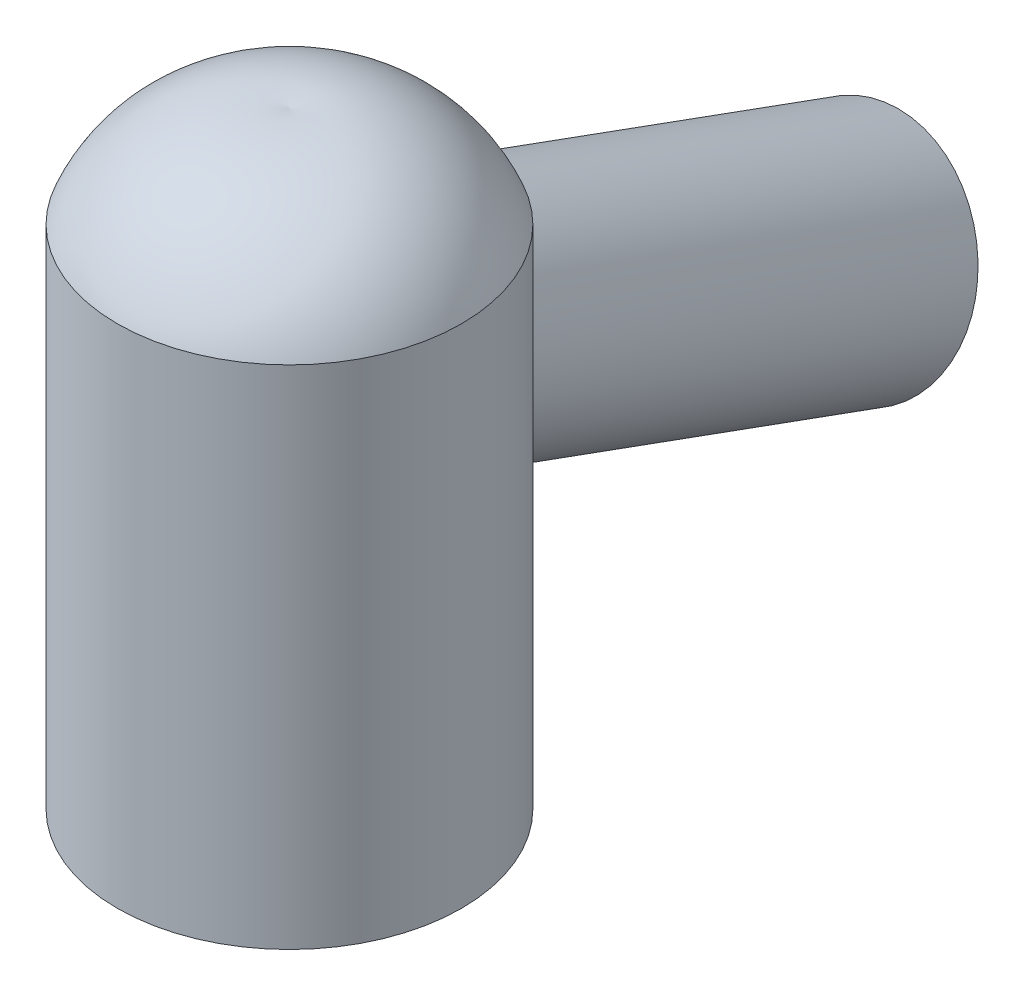
ISO-10303-21;
HEADER;
FILE_DESCRIPTION(('STEP AP214'),'2;1');
FILE_NAME('part.step','',(''),(''),'','','');
FILE_SCHEMA(('AUTOMOTIVE_DESIGN { 1 0 10303 214 1 1 1 1 }'));
ENDSEC;
DATA;
#1=APPLICATION_CONTEXT('core data for automotive mechanical design processes');
#2=APPLICATION_PROTOCOL_DEFINITION('international standard','automotive_design',2000,#1);
#3=PRODUCT_CONTEXT('',#1,'mechanical');
#4=PRODUCT('Part','Part','',(#3));
#5=PRODUCT_RELATED_PRODUCT_CATEGORY('part','',(#4));
#6=PRODUCT_DEFINITION_FORMATION('','',#4);
#7=PRODUCT_DEFINITION_CONTEXT('part definition',#1,'design');
#8=PRODUCT_DEFINITION('design','',#6,#7);
#9=PRODUCT_DEFINITION_SHAPE('','',#8);
#10=(LENGTH_UNIT() NAMED_UNIT(*) SI_UNIT(.MILLI.,.METRE.));
#11=(NAMED_UNIT(*) PLANE_ANGLE_UNIT() SI_UNIT($,.RADIAN.));
#12=(NAMED_UNIT(*) SI_UNIT($,.STERADIAN.) SOLID_ANGLE_UNIT());
#13=UNCERTAINTY_MEASURE_WITH_UNIT(LENGTH_MEASURE(1.E-05),#10,'distance_accuracy_value','');
#14=(GEOMETRIC_REPRESENTATION_CONTEXT(3) GLOBAL_UNCERTAINTY_ASSIGNED_CONTEXT((#13)) GLOBAL_UNIT_ASSIGNED_CONTEXT((#10,
#11,#12)) REPRESENTATION_CONTEXT('',''));
#15=CARTESIAN_POINT('',(0.,0.,0.));
#16=DIRECTION('',(0.,0.,1.));
#17=DIRECTION('',(1.,0.,0.));
#18=AXIS2_PLACEMENT_3D('',#15,#16,#17);
#19=CARTESIAN_POINT('',(0.,25.,0.));
#20=DIRECTION('',(0.,-1.,0.));
#21=DIRECTION('',(0.,0.,-1.));
#22=AXIS2_PLACEMENT_3D('',#19,#20,#21);
#23=CYLINDRICAL_SURFACE('',#22,8.5);
#24=CARTESIAN_POINT('',(0.,22.7592307573548,-8.5));
#25=CARTESIAN_POINT('',(0.150595067159695,22.7592302077877,-8.49999902727037));
#26=CARTESIAN_POINT('',(0.30121214763485,22.7541016183976,-8.49598976296606));
#27=CARTESIAN_POINT('',(0.601385081197717,22.7336131139282,-8.48003209892369));
#28=CARTESIAN_POINT('',(0.750940389950452,22.7182482869277,-8.46807988772093));
#29=CARTESIAN_POINT('',(1.04807162124385,22.6773434857078,-8.4364625741855));
#30=CARTESIAN_POINT('',(1.1956440377708,22.6517874515007,-8.41678529894236));
#31=CARTESIAN_POINT('',(1.48757377260865,22.5906321443636,-8.37012454733665));
#32=CARTESIAN_POINT('',(1.63192979634185,22.5550289035616,-8.34313818461787));
#33=CARTESIAN_POINT('',(1.91595348408234,22.4740872908909,-8.28252043151505));
#34=CARTESIAN_POINT('',(2.05563414460332,22.4287790466718,-8.24890963087172));
#35=CARTESIAN_POINT('',(2.32992995855837,22.3285397586367,-8.17567034856265));
#36=CARTESIAN_POINT('',(2.46454316517492,22.2736050614456,-8.13603958299819));
#37=CARTESIAN_POINT('',(2.72776577118698,22.1543504740688,-8.05160780366938));
#38=CARTESIAN_POINT('',(2.85637824648766,22.0900354634589,-8.00680948055186));
#39=CARTESIAN_POINT('',(3.10698870454238,21.9521463359055,-7.91293469492467));
#40=CARTESIAN_POINT('',(3.22898349100475,21.8785678007351,-7.86385619444492));
#41=CARTESIAN_POINT('',(3.46952838393685,21.719737160123,-7.76080241755362));
#42=CARTESIAN_POINT('',(3.5878300489095,21.6341788224731,-7.70671871979084));
#43=CARTESIAN_POINT('',(3.81578324672473,21.4535568494065,-7.59643488237149));
#44=CARTESIAN_POINT('',(3.9254387583245,21.3584976322809,-7.54023573399466));
#45=CARTESIAN_POINT('',(4.13555091640766,21.1588769629079,-7.4270768329607));
#46=CARTESIAN_POINT('',(4.23599849385566,21.0543063404046,-7.37011639242225));
#47=CARTESIAN_POINT('',(4.42680076108425,20.8359616412575,-7.25711537135729));
#48=CARTESIAN_POINT('',(4.51716061131283,20.7221923221092,-7.20107433313684));
#49=CARTESIAN_POINT('',(4.68648247491537,20.4865352847654,-7.09203430160564));
#50=CARTESIAN_POINT('',(4.76552337165715,20.3647133738945,-7.03901597878351));
#51=CARTESIAN_POINT('',(4.91222609640696,20.1127304607862,-6.93743440175615));
#52=CARTESIAN_POINT('',(4.97989468496004,19.9825744769552,-6.88886850855675));
#53=CARTESIAN_POINT('',(5.10313430660092,19.7148427704883,-6.79807878971528));
#54=CARTESIAN_POINT('',(5.15872720589601,19.5772810314019,-6.75584354450727));
#55=CARTESIAN_POINT('',(5.25745350938184,19.295640352303,-6.67930362018277));
#56=CARTESIAN_POINT('',(5.30058965228421,19.1515628528985,-6.64499719818653));
#57=CARTESIAN_POINT('',(5.36863982039829,18.8804068056346,-6.59009230260482));
#58=CARTESIAN_POINT('',(5.39531787852993,18.7540265281905,-6.56820870468501));
#59=CARTESIAN_POINT('',(5.43957202389027,18.498612740854,-6.53160659266219));
#60=CARTESIAN_POINT('',(5.45714491864975,18.3695783168244,-6.51689059178365));
#61=CARTESIAN_POINT('',(5.48340450185452,18.1099405050581,-6.49481100247284));
#62=CARTESIAN_POINT('',(5.49208741596057,17.979336474716,-6.48745053694589));
#63=CARTESIAN_POINT('',(5.50093862547104,17.7176870035076,-6.47994621255126));
#64=CARTESIAN_POINT('',(5.50110893167303,17.5866416741966,-6.47980064942235));
#65=CARTESIAN_POINT('',(5.4926421774879,17.2984457208055,-6.48698158169763));
#66=CARTESIAN_POINT('',(5.48221416896205,17.1413838888558,-6.49582753908152));
#67=CARTESIAN_POINT('',(5.45065767348368,16.829134047329,-6.52232568127632));
#68=CARTESIAN_POINT('',(5.42952685824862,16.6739464529965,-6.53997978219332));
#69=CARTESIAN_POINT('',(5.35128572454736,16.211898466983,-6.60442246088304));
#70=CARTESIAN_POINT('',(5.27934539157401,15.9090213315867,-6.66267309028977));
#71=CARTESIAN_POINT('',(5.1292598218117,15.411199816664,-6.77839175036924));
#72=CARTESIAN_POINT('',(5.06006353535934,15.2120796574478,-6.83042659947094));
#73=CARTESIAN_POINT('',(4.90647780989961,14.8216848620278,-6.94157592899216));
#74=CARTESIAN_POINT('',(4.82208211660757,14.630413495393,-7.00069332038645));
#75=CARTESIAN_POINT('',(4.63860179758311,14.2565142602597,-7.12359285210665));
#76=CARTESIAN_POINT('',(4.53950904881465,14.0738912458011,-7.18737756211069));
#77=CARTESIAN_POINT('',(4.3267868762706,13.7182905818512,-7.31740773713319));
#78=CARTESIAN_POINT('',(4.21316188805855,13.5453100123063,-7.38365244694479));
#79=CARTESIAN_POINT('',(3.99238378669133,13.2395439327986,-7.50492054819431));
#80=CARTESIAN_POINT('',(3.88758652376008,13.1050271184749,-7.55987581154332));
#81=CARTESIAN_POINT('',(3.66774429367691,12.8442371023581,-7.6689447678973));
#82=CARTESIAN_POINT('',(3.55269894467173,12.7179642080451,-7.72305842945508));
#83=CARTESIAN_POINT('',(3.31239621494932,12.4751154640299,-7.82912690245986));
#84=CARTESIAN_POINT('',(3.18716275446289,12.3585181285688,-7.88108636168011));
#85=CARTESIAN_POINT('',(2.92615399621796,12.13621467794,-7.98168005241646));
#86=CARTESIAN_POINT('',(2.79037842410831,12.0305088463828,-8.03031419733158));
#87=CARTESIAN_POINT('',(2.44715179700049,11.7888012392102,-8.14288306216883));
#88=CARTESIAN_POINT('',(2.23405261286942,11.6594076773036,-8.20436498271127));
#89=CARTESIAN_POINT('',(1.89952682596397,11.4898928881746,-8.28583216970473));
#90=CARTESIAN_POINT('',(1.78550986667734,11.4374743510148,-8.31120003186689));
#91=CARTESIAN_POINT('',(1.55292803656773,11.3416903049842,-8.3577781127885));
#92=CARTESIAN_POINT('',(1.43436524116948,11.2983207216803,-8.37899020248587));
#93=CARTESIAN_POINT('',(1.192042594445,11.2210840433057,-8.41690166336664));
#94=CARTESIAN_POINT('',(1.06824082811628,11.1873231236481,-8.43355054206334));
#95=CARTESIAN_POINT('',(0.817559019686375,11.130719177093,-8.46153036731061));
#96=CARTESIAN_POINT('',(0.690679002884789,11.1078760604959,-8.47286135755239));
#97=CARTESIAN_POINT('',(0.435105678160918,11.0737240636548,-8.4898214746802));
#98=CARTESIAN_POINT('',(0.306414083693191,11.0624049409733,-8.4954556648079));
#99=CARTESIAN_POINT('',(0.0484188482765502,11.0515854493114,-8.50084080214499));
#100=CARTESIAN_POINT('',(-0.0808847058892342,11.0520834519321,-8.50059255995299));
#101=CARTESIAN_POINT('',(-0.319583905701683,11.0639228401787,-8.49470053081617));
#102=CARTESIAN_POINT('',(-0.429084349058265,11.073642946439,-8.48986348388972));
#103=CARTESIAN_POINT('',(-0.646789191214288,11.1014360902037,-8.47605812753648));
#104=CARTESIAN_POINT('',(-0.754993191972644,11.1195116288671,-8.46708858106817));
#105=CARTESIAN_POINT('',(-0.969351505350982,11.163672425484,-8.44523341707152));
#106=CARTESIAN_POINT('',(-1.07550566205435,11.1897582901934,-8.43234750289191));
#107=CARTESIAN_POINT('',(-1.28516126294924,11.2494796728919,-8.40295028694009));
#108=CARTESIAN_POINT('',(-1.38866215922618,11.2831167364778,-8.38643824297839));
#109=CARTESIAN_POINT('',(-1.61774921862148,11.3666111406835,-8.34563103948399));
#110=CARTESIAN_POINT('',(-1.74246410038297,11.4184225589371,-8.32042098881983));
#111=CARTESIAN_POINT('',(-1.98629971000509,11.5318630078975,-8.26560687980744));
#112=CARTESIAN_POINT('',(-2.10541917239137,11.5934942457694,-8.23600183371453));
#113=CARTESIAN_POINT('',(-2.45407260722473,11.7916925477227,-8.14158936555265));
#114=CARTESIAN_POINT('',(-2.674723728475,11.9414969097521,-8.07121804016957));
#115=CARTESIAN_POINT('',(-3.02637828589024,12.2179083323858,-7.94446191870476));
#116=CARTESIAN_POINT('',(-3.1640451353018,12.3374249191361,-7.89045526434821));
#117=CARTESIAN_POINT('',(-3.42756866983338,12.5876903886121,-7.77959985488574));
#118=CARTESIAN_POINT('',(-3.55342448941366,12.718440093184,-7.72275089195603));
#119=CARTESIAN_POINT('',(-3.79370615065001,12.9898192163119,-7.60760042325959));
#120=CARTESIAN_POINT('',(-3.90811255821102,13.1304647653841,-7.54929665082169));
#121=CARTESIAN_POINT('',(-4.12552725583711,13.420266841557,-7.43271360625303));
#122=CARTESIAN_POINT('',(-4.22853683493595,13.5694224032377,-7.37443433209572));
#123=CARTESIAN_POINT('',(-4.42647512978502,13.8802986013337,-7.2574070084905));
#124=CARTESIAN_POINT('',(-4.52103802099619,14.0422689435309,-7.19870402677727));
#125=CARTESIAN_POINT('',(-4.69825008991862,14.373650280368,-7.08431829807819));
#126=CARTESIAN_POINT('',(-4.78089766854822,14.5430622697332,-7.02863595709844));
#127=CARTESIAN_POINT('',(-4.93397038352421,14.8885893274657,-6.9220392501079));
#128=CARTESIAN_POINT('',(-5.00440751292818,15.0646976090106,-6.87112022847958));
#129=CARTESIAN_POINT('',(-5.13259061100356,15.4231099606928,-6.77590395451434));
#130=CARTESIAN_POINT('',(-5.19034034343654,15.6054121747979,-6.73160473963868));
#131=CARTESIAN_POINT('',(-5.31827958537841,16.0700297855359,-6.63140595462931));
#132=CARTESIAN_POINT('',(-5.37988531339688,16.356106127351,-6.58104548090218));
#133=CARTESIAN_POINT('',(-5.4456079228142,16.7915087320721,-6.52657035446956));
#134=CARTESIAN_POINT('',(-5.46306585598351,16.9376210252418,-6.51192484571576));
#135=CARTESIAN_POINT('',(-5.48838817385267,17.2312903653784,-6.49060008706314));
#136=CARTESIAN_POINT('',(-5.49625427985404,17.3788471483321,-6.48391940784047));
#137=CARTESIAN_POINT('',(-5.50123374677148,17.6516178998485,-6.47969352641695));
#138=CARTESIAN_POINT('',(-5.49981141311796,17.7767871905739,-6.48090420315677));
#139=CARTESIAN_POINT('',(-5.48914820169315,18.0265468150099,-6.48993873769612));
#140=CARTESIAN_POINT('',(-5.47990886470195,18.1511372579493,-6.49776129225301));
#141=CARTESIAN_POINT('',(-5.45329743910928,18.398795479803,-6.52011103463307));
#142=CARTESIAN_POINT('',(-5.43592863530642,18.5218638531295,-6.53463551443763));
#143=CARTESIAN_POINT('',(-5.39287118723353,18.7655830843903,-6.57021451947613));
#144=CARTESIAN_POINT('',(-5.36718240635151,18.8862339025943,-6.59126915193333));
#145=CARTESIAN_POINT('',(-5.30744424330352,19.1242298655121,-6.6394657440984));
#146=CARTESIAN_POINT('',(-5.27339307637847,19.2415742985863,-6.66660900317641));
#147=CARTESIAN_POINT('',(-5.19704916403498,19.4721293095225,-6.72629356848591));
#148=CARTESIAN_POINT('',(-5.15475629142546,19.5853398235554,-6.75883495802351));
#149=CARTESIAN_POINT('',(-5.06213579837326,19.8070456521085,-6.82847956761139));
#150=CARTESIAN_POINT('',(-5.01180367900877,19.9155382828991,-6.86558533929192));
#151=CARTESIAN_POINT('',(-4.90343927957703,20.1272821360327,-6.94339569060842));
#152=CARTESIAN_POINT('',(-4.84540386011459,20.2305311975701,-6.98410173522716));
#153=CARTESIAN_POINT('',(-4.65799515055572,20.5355739458105,-7.11168882475037));
#154=CARTESIAN_POINT('',(-4.51700643172417,20.7286397055818,-7.20271642569128));
#155=CARTESIAN_POINT('',(-4.20782562935109,21.0899026143061,-7.38759904525198));
#156=CARTESIAN_POINT('',(-4.03962600536491,21.2580928451719,-7.4814548417129));
#157=CARTESIAN_POINT('',(-3.75513468503997,21.503523618931,-7.62645130832245));
#158=CARTESIAN_POINT('',(-3.64674595152789,21.5892751862341,-7.67896247286374));
#159=CARTESIAN_POINT('',(-3.4225036249133,21.7521235896649,-7.78149387304208));
#160=CARTESIAN_POINT('',(-3.30664963320725,21.8292199630493,-7.83151397541694));
#161=CARTESIAN_POINT('',(-3.06803792446402,21.9746604282889,-7.92803419725674));
#162=CARTESIAN_POINT('',(-2.94527458278184,22.0429972365548,-7.97453137443763));
#163=CARTESIAN_POINT('',(-2.69360573015035,22.1706893139494,-8.06301921212482));
#164=CARTESIAN_POINT('',(-2.56470028358841,22.230044677203,-8.10500991985721));
#165=CARTESIAN_POINT('',(-2.29285190546105,22.3431856752511,-8.18622290648646));
#166=CARTESIAN_POINT('',(-2.14954246457227,22.39635226863,-8.22508396609076));
#167=CARTESIAN_POINT('',(-1.85780447783022,22.4920425003649,-8.2958473178068));
#168=CARTESIAN_POINT('',(-1.70937788551634,22.534570150188,-8.32775223218333));
#169=CARTESIAN_POINT('',(-1.40869864160155,22.6087241591087,-8.38384849578269));
#170=CARTESIAN_POINT('',(-1.25645353589839,22.6403704410423,-8.40805393591679));
#171=CARTESIAN_POINT('',(-0.949089601004228,22.6926717040104,-8.44826771177712));
#172=CARTESIAN_POINT('',(-0.793972400947098,22.7133327298085,-8.46428055539032));
#173=CARTESIAN_POINT('',(-0.532206732439943,22.7386965229306,-8.4839867090505));
#174=CARTESIAN_POINT('',(-0.426007516081268,22.7463942317372,-8.48998557374621));
#175=CARTESIAN_POINT('',(-0.213209213595068,22.7566615729738,-8.49799258648688));
#176=CARTESIAN_POINT('',(-0.106610122881348,22.7592311464075,-8.50000068862033));
#177=CARTESIAN_POINT('',(0.,22.7592307573548,-8.5));
#178=B_SPLINE_CURVE_WITH_KNOTS('',3,(#24,#25,#26,#27,#28,#29,#30,#31,#32,#33,#34,#35,#36,#37,
#38,#39,#40,#41,#42,#43,#44,#45,#46,#47,#48,#49,#50,#51,#52,#53,#54,#55,#56,#57,#58,#59,#60,#61,
#62,#63,#64,#65,#66,#67,#68,#69,#70,#71,#72,#73,#74,#75,#76,#77,#78,#79,#80,#81,#82,#83,#84,#85,
#86,#87,#88,#89,#90,#91,#92,#93,#94,#95,#96,#97,#98,#99,#100,#101,#102,#103,#104,#105,#106,#107,
#108,#109,#110,#111,#112,#113,#114,#115,#116,#117,#118,#119,#120,#121,#122,#123,#124,#125,#126,
#127,#128,#129,#130,#131,#132,#133,#134,#135,#136,#137,#138,#139,#140,#141,#142,#143,#144,#145,
#146,#147,#148,#149,#150,#151,#152,#153,#154,#155,#156,#157,#158,#159,#160,#161,#162,#163,#164,
#165,#166,#167,#168,#169,#170,#171,#172,#173,#174,#175,#176,#177),.UNSPECIFIED.,.T.,.F.,(4,2,2,
2,2,2,2,2,2,2,2,2,2,2,2,2,2,2,2,2,2,2,2,2,2,2,2,2,2,2,2,2,2,2,2,2,2,2,2,2,2,2,2,2,2,2,2,2,2,2,2,
2,2,2,2,2,2,2,2,2,2,2,2,2,2,2,2,2,2,2,2,2,2,2,2,2,4),(0.,0.451683384654199,0.9035836686011,
1.35619891942966,1.80899316913534,2.26040165125211,2.71198182177098,3.16332791567171,
3.61489009990075,4.08142891222674,4.54775176590516,5.01452908127405,5.4810665085413,
5.9441753151175,6.40700783402453,6.86899515448261,7.33088082608642,7.72337161252821,
8.11599992184992,8.50879485681005,8.90149700765023,9.37374226073887,9.84609028994513,
10.7921766285404,11.4428977997535,12.0938873454471,12.7452380420137,13.3963904041637,
13.9334218379268,14.4704732903597,15.0062983274248,15.542137313641,16.3091847272301,
16.6928908294976,17.0764237874576,17.4640433882032,17.8516598042508,18.2389314082482,
18.6261496465654,18.9558640420059,19.285677199868,19.6155153461618,19.9454210661402,
20.3569479740092,20.7685675101017,21.5923787102655,22.1621676723552,22.7319983573525,
23.3027804207329,23.8734978598949,24.4625464637254,25.0516740467458,25.6402196713475,
26.2285904653284,27.1158544026793,27.5590712718754,28.0022085918689,28.3773720435269,
28.7524615653532,29.1273996588846,29.5023439091197,29.8773682522379,30.252398383421,
30.6276391290069,31.0030332720726,31.7673466582774,32.5318722081696,32.9750074454924,
33.418166363426,33.8616914106628,34.3052118094715,34.7777686630073,35.2501470671369,
35.7216559238314,36.1929050581369,36.5126596694536,36.8324179593475),.UNSPECIFIED.);
#179=CARTESIAN_POINT('',(0.,22.7592307573548,-8.5));
#180=VERTEX_POINT('',#179);
#181=EDGE_CURVE('E61',#180,#180,#178,.T.);
#182=ORIENTED_EDGE('',*,*,#181,.F.);
#183=EDGE_LOOP('',(#182));
#184=FACE_BOUND('',#183,.T.);
#185=CARTESIAN_POINT('',(0.,25.,0.));
#186=DIRECTION('',(0.,1.,0.));
#187=DIRECTION('',(0.,0.,1.));
#188=AXIS2_PLACEMENT_3D('',#185,#186,#187);
#189=CIRCLE('',#188,8.5);
#190=CARTESIAN_POINT('',(0.,25.,8.5));
#191=VERTEX_POINT('',#190);
#192=EDGE_CURVE('E11',#191,#191,#189,.T.);
#193=ORIENTED_EDGE('',*,*,#192,.F.);
#194=EDGE_LOOP('',(#193));
#195=FACE_BOUND('',#194,.T.);
#196=CARTESIAN_POINT('',(0.,0.,0.));
#197=DIRECTION('',(0.,1.,0.));
#198=DIRECTION('',(0.,0.,1.));
#199=AXIS2_PLACEMENT_3D('',#196,#197,#198);
#200=CIRCLE('',#199,8.5);
#201=CARTESIAN_POINT('',(0.,0.,8.5));
#202=VERTEX_POINT('',#201);
#203=EDGE_CURVE('E37',#202,#202,#200,.T.);
#204=ORIENTED_EDGE('',*,*,#203,.T.);
#205=EDGE_LOOP('',(#204));
#206=FACE_BOUND('',#205,.T.);
#207=ADVANCED_FACE('F34',(#184,#195,#206),#23,.T.);
#208=CARTESIAN_POINT('',(0.,0.,0.));
#209=DIRECTION('',(0.,1.,0.));
#210=DIRECTION('',(0.,0.,1.));
#211=AXIS2_PLACEMENT_3D('',#208,#209,#210);
#212=PLANE('',#211);
#213=CARTESIAN_POINT('',(0.,0.,0.));
#214=DIRECTION('',(0.,1.,0.));
#215=DIRECTION('',(0.,0.,1.));
#216=AXIS2_PLACEMENT_3D('',#213,#214,#215);
#217=CIRCLE('',#216,5.);
#218=CARTESIAN_POINT('',(0.,0.,5.));
#219=VERTEX_POINT('',#218);
#220=EDGE_CURVE('E58',#219,#219,#217,.T.);
#221=ORIENTED_EDGE('',*,*,#220,.T.);
#222=EDGE_LOOP('',(#221));
#223=FACE_BOUND('',#222,.T.);
#224=ORIENTED_EDGE('',*,*,#203,.F.);
#225=EDGE_LOOP('',(#224));
#226=FACE_BOUND('',#225,.T.);
#227=ADVANCED_FACE('F101',(#223,#226),#212,.F.);
#228=CARTESIAN_POINT('',(0.,22.0699854658927,-1.05587380346627));
#229=DIRECTION('',(-1.,0.,0.));
#230=DIRECTION('',(0.,0.,-1.));
#231=AXIS2_PLACEMENT_3D('',#228,#229,#230);
#232=CIRCLE('',#231,8.);
#233=TRIMMED_CURVE('',#232,(PARAMETER_VALUE(-1.7031667781396)),
(PARAMETER_VALUE(1.7031667781396)),.T.,.PARAMETER.);
#234=CARTESIAN_POINT('',(0.,22.0699854658927,0.));
#235=DIRECTION('',(0.,-1.,0.));
#236=AXIS1_PLACEMENT('',#234,#235);
#237=SURFACE_OF_REVOLUTION('',#233,#236);
#238=CARTESIAN_POINT('',(0.,30.,0.));
#239=VERTEX_POINT('',#238);
#240=VERTEX_LOOP('',#239);
#241=FACE_BOUND('',#240,.T.);
#242=ORIENTED_EDGE('',*,*,#192,.T.);
#243=EDGE_LOOP('',(#242));
#244=FACE_BOUND('',#243,.T.);
#245=ADVANCED_FACE('F89',(#241,#244),#237,.T.);
#246=CARTESIAN_POINT('',(0.,9.73939570023004,-28.1907786235773));
#247=DIRECTION('',(0.,-0.342020143325666,-0.93969262078591));
#248=DIRECTION('',(0.,0.93969262078591,-0.342020143325666));
#249=AXIS2_PLACEMENT_3D('',#246,#247,#248);
#250=PLANE('',#249);
#251=CARTESIAN_POINT('',(0.,9.73939570023004,-28.1907786235773));
#252=DIRECTION('',(0.,-0.342020143325666,-0.93969262078591));
#253=DIRECTION('',(0.,0.93969262078591,-0.342020143325666));
#254=AXIS2_PLACEMENT_3D('',#251,#252,#253);
#255=CIRCLE('',#254,2.);
#256=CARTESIAN_POINT('',(0.,11.6187809418019,-28.8748189102286));
#257=VERTEX_POINT('',#256);
#258=EDGE_CURVE('E73',#257,#257,#255,.T.);
#259=ORIENTED_EDGE('',*,*,#258,.F.);
#260=EDGE_LOOP('',(#259));
#261=FACE_BOUND('',#260,.T.);
#262=CARTESIAN_POINT('',(0.,9.73939570023004,-28.1907786235773));
#263=DIRECTION('',(0.,-0.342020143325666,-0.93969262078591));
#264=DIRECTION('',(0.,0.93969262078591,-0.342020143325666));
#265=AXIS2_PLACEMENT_3D('',#262,#263,#264);
#266=CIRCLE('',#265,5.5);
#267=CARTESIAN_POINT('',(0.,14.9077051145525,-30.0718894118685));
#268=VERTEX_POINT('',#267);
#269=EDGE_CURVE('E57',#268,#268,#266,.T.);
#270=ORIENTED_EDGE('',*,*,#269,.T.);
#271=EDGE_LOOP('',(#270));
#272=FACE_BOUND('',#271,.T.);
#273=ADVANCED_FACE('F87',(#261,#272),#250,.T.);
#274=CARTESIAN_POINT('',(0.,23.9102502414794,10.7433242428817));
#275=DIRECTION('',(0.,-0.342020143325666,-0.939692620785909));
#276=DIRECTION('',(0.,0.93969262078591,-0.342020143325666));
#277=AXIS2_PLACEMENT_3D('',#274,#275,#276);
#278=CYLINDRICAL_SURFACE('',#277,5.5);
#279=ORIENTED_EDGE('',*,*,#269,.F.);
#280=EDGE_LOOP('',(#279));
#281=FACE_BOUND('',#280,.T.);
#282=ORIENTED_EDGE('',*,*,#181,.T.);
#283=EDGE_LOOP('',(#282));
#284=FACE_BOUND('',#283,.T.);
#285=ADVANCED_FACE('F82',(#281,#284),#278,.T.);
#286=CARTESIAN_POINT('',(0.,25.,0.));
#287=DIRECTION('',(0.,-1.,0.));
#288=DIRECTION('',(0.,0.,-1.));
#289=AXIS2_PLACEMENT_3D('',#286,#287,#288);
#290=CYLINDRICAL_SURFACE('',#289,5.);
#291=CARTESIAN_POINT('',(-0.0444416929884666,16.0523906912879,-4.9998024896926));
#292=CARTESIAN_POINT('',(-0.141878929498869,16.0550206954667,-4.99893164600773));
#293=CARTESIAN_POINT('',(-0.239192830365653,16.0663235301392,-4.99518601073743));
#294=CARTESIAN_POINT('',(-0.430174573128614,16.1054502225358,-4.98238621626885));
#295=CARTESIAN_POINT('',(-0.523833464393543,16.1333122195299,-4.97331980279464));
#296=CARTESIAN_POINT('',(-0.704259892755459,16.2034165006551,-4.95098304321109));
#297=CARTESIAN_POINT('',(-0.791069628323585,16.2455605816791,-4.93774144765627));
#298=CARTESIAN_POINT('',(-0.956963739075026,16.3420457172046,-4.90829223870789));
#299=CARTESIAN_POINT('',(-1.03604837244489,16.3963863638751,-4.89208472449261));
#300=CARTESIAN_POINT('',(-1.19356514166954,16.5214174783111,-4.85619146878994));
#301=CARTESIAN_POINT('',(-1.27106481385835,16.5932232787814,-4.83631923922687));
#302=CARTESIAN_POINT('',(-1.41521138806298,16.746878978538,-4.7961217897131));
#303=CARTESIAN_POINT('',(-1.48185155629128,16.8287350550857,-4.77579629751451));
#304=CARTESIAN_POINT('',(-1.61664732437192,17.0185672130595,-4.73206807482279));
#305=CARTESIAN_POINT('',(-1.68223114431194,17.1284336616808,-4.70890543509131));
#306=CARTESIAN_POINT('',(-1.79626360374995,17.3575592370017,-4.66659851385733));
#307=CARTESIAN_POINT('',(-1.8446945605121,17.4768279024532,-4.64745838734299));
#308=CARTESIAN_POINT('',(-1.92646948372248,17.7330414983365,-4.61420124374605));
#309=CARTESIAN_POINT('',(-1.95811087458598,17.8706183416348,-4.60067443562237));
#310=CARTESIAN_POINT('',(-1.99689901529147,18.14980155939,-4.58398106505168));
#311=CARTESIAN_POINT('',(-2.00407632301671,18.2914026839356,-4.58080157807645));
#312=CARTESIAN_POINT('',(-1.99212489326476,18.5582423187919,-4.58600703355978));
#313=CARTESIAN_POINT('',(-1.97571280827727,18.6836193375615,-4.59319797989108));
#314=CARTESIAN_POINT('',(-1.92033931975265,18.92839138674,-4.61662166136614));
#315=CARTESIAN_POINT('',(-1.8813993940808,19.0477919973649,-4.63284578379798));
#316=CARTESIAN_POINT('',(-1.78836183050642,19.2601703411918,-4.66946137375903));
#317=CARTESIAN_POINT('',(-1.73705001596901,19.3545321754136,-4.68898462081019));
#318=CARTESIAN_POINT('',(-1.61928612454961,19.532553702519,-4.73094147918997));
#319=CARTESIAN_POINT('',(-1.55283424777656,19.6162135368299,-4.75337505205061));
#320=CARTESIAN_POINT('',(-1.4079290669605,19.7694725574302,-4.79826788782842));
#321=CARTESIAN_POINT('',(-1.32970429556442,19.8392907497768,-4.82071993489729));
#322=CARTESIAN_POINT('',(-1.16253374645027,19.9653449657044,-4.86373924166373));
#323=CARTESIAN_POINT('',(-1.07358686517751,20.0215795894278,-4.88430630696867));
#324=CARTESIAN_POINT('',(-0.88387107476229,20.1213212650744,-4.9222409751385));
#325=CARTESIAN_POINT('',(-0.782788920344048,20.1642880809185,-4.93946418458101));
#326=CARTESIAN_POINT('',(-0.5743613824537,20.233898891555,-4.9680149628038));
#327=CARTESIAN_POINT('',(-0.467015460547376,20.2605414808445,-4.97934202391774));
#328=CARTESIAN_POINT('',(-0.247385977930615,20.2973267433648,-4.9951069839096));
#329=CARTESIAN_POINT('',(-0.135052803904836,20.3072188968576,-4.99944023935916));
#330=CARTESIAN_POINT('',(0.0898281157011518,20.3095549961126,-5.00045749649717));
#331=CARTESIAN_POINT('',(0.202375861936775,20.3019988884932,-4.99714147478323));
#332=CARTESIAN_POINT('',(0.424307816539131,20.269597321712,-4.98320258690542));
#333=CARTESIAN_POINT('',(0.533696702465887,20.2447789529215,-4.97259117000425));
#334=CARTESIAN_POINT('',(0.746417427573569,20.1783053821456,-4.945135778007));
#335=CARTESIAN_POINT('',(0.849748790411495,20.1366488580931,-4.9282913135248));
#336=CARTESIAN_POINT('',(1.04762320811972,20.0371178486688,-4.89005781248074));
#337=CARTESIAN_POINT('',(1.14214937387994,19.9792130174758,-4.868660290742));
#338=CARTESIAN_POINT('',(1.31947124396036,19.8482693519834,-4.82362653608887));
#339=CARTESIAN_POINT('',(1.40226778452752,19.7752315974794,-4.79999046296949));
#340=CARTESIAN_POINT('',(1.55276979242536,19.6165021873355,-4.75342533604097));
#341=CARTESIAN_POINT('',(1.62064336584918,19.530971727147,-4.73049121309296));
#342=CARTESIAN_POINT('',(1.74053359841546,19.3487771911234,-4.6877086891153));
#343=CARTESIAN_POINT('',(1.79255701791663,19.2521178862362,-4.66785897430847));
#344=CARTESIAN_POINT('',(1.87787463891909,19.054208227018,-4.63418022791154));
#345=CARTESIAN_POINT('',(1.9117850917775,18.9532557383738,-4.62015729130423));
#346=CARTESIAN_POINT('',(1.96336317236258,18.7466503576917,-4.59847741952168));
#347=CARTESIAN_POINT('',(1.98102996465953,18.6409972241874,-4.59082081177583));
#348=CARTESIAN_POINT('',(2.0006263977551,18.4274510213708,-4.58231456245165));
#349=CARTESIAN_POINT('',(2.00247129944126,18.3195489896949,-4.58150157445901));
#350=CARTESIAN_POINT('',(1.99122401394493,18.1047061567609,-4.58639882560225));
#351=CARTESIAN_POINT('',(1.97812646550613,17.9977657143939,-4.59211140607164));
#352=CARTESIAN_POINT('',(1.93600796605109,17.7755986607065,-4.61003818863722));
#353=CARTESIAN_POINT('',(1.90542198493926,17.6607223185237,-4.62288715887779));
#354=CARTESIAN_POINT('',(1.82874021193065,17.4369462154248,-4.65375192440907));
#355=CARTESIAN_POINT('',(1.78262932250103,17.3280523927031,-4.67177274665159));
#356=CARTESIAN_POINT('',(1.6681321773754,17.1029936945019,-4.71397792089586));
#357=CARTESIAN_POINT('',(1.59748350552115,16.988069397776,-4.738677303664));
#358=CARTESIAN_POINT('',(1.43804650345277,16.7718816124047,-4.78946824546619));
#359=CARTESIAN_POINT('',(1.34926685394996,16.6706116247567,-4.8155591338777));
#360=CARTESIAN_POINT('',(1.17318511678989,16.5036524687079,-4.86109388107935));
#361=CARTESIAN_POINT('',(1.08890141135033,16.4348680449142,-4.88084911208622));
#362=CARTESIAN_POINT('',(0.909804028835081,16.3116553934596,-4.91737402543267));
#363=CARTESIAN_POINT('',(0.815002233671157,16.2572111961733,-4.93414702203596));
#364=CARTESIAN_POINT('',(0.631772910946721,16.1728201062813,-4.96065329199345));
#365=CARTESIAN_POINT('',(0.544584893965753,16.1404011515752,-4.97107062872356));
#366=CARTESIAN_POINT('',(0.365810842827625,16.0900176115333,-4.98740213874612));
#367=CARTESIAN_POINT('',(0.274235605724375,16.0720192963155,-4.99332681861399));
#368=CARTESIAN_POINT('',(0.144279367848022,16.0576631014392,-4.9980604715941));
#369=CARTESIAN_POINT('',(0.106605501979624,16.0548012872105,-4.99900572502534));
#370=CARTESIAN_POINT('',(0.0311343569928154,16.0516550455407,-5.00004561655736));
#371=CARTESIAN_POINT('',(-0.00666293851502036,16.0513709755644,-5.00014013668397));
#372=CARTESIAN_POINT('',(-0.0444416929884666,16.0523906912879,-4.9998024896926));
#373=B_SPLINE_CURVE_WITH_KNOTS('',3,(#291,#292,#293,#294,#295,#296,#297,#298,#299,#300,#301,
#302,#303,#304,#305,#306,#307,#308,#309,#310,#311,#312,#313,#314,#315,#316,#317,#318,#319,#320,
#321,#322,#323,#324,#325,#326,#327,#328,#329,#330,#331,#332,#333,#334,#335,#336,#337,#338,#339,
#340,#341,#342,#343,#344,#345,#346,#347,#348,#349,#350,#351,#352,#353,#354,#355,#356,#357,#358,
#359,#360,#361,#362,#363,#364,#365,#366,#367,#368,#369,#370,#371,#372),.UNSPECIFIED.,.T.,.F.,(4,
2,2,2,2,2,2,2,2,2,2,2,2,2,2,2,2,2,2,2,2,2,2,2,2,2,2,2,2,2,2,2,2,2,2,2,2,2,2,2,4),(0.,
0.292263760572639,0.585203289660878,0.876168123066085,1.16712322858322,1.48849421092026,
1.81006371764892,2.19856714377924,2.58746991684231,3.01059401088279,3.43318939006179,
3.81083864255908,4.18812843920283,4.51404615339045,4.83995956011469,5.16021143643413,
5.48049630231448,5.81248604606422,6.14450436985409,6.4814458822352,6.81838842546471,
7.15480338057524,7.49124475482416,7.8283187076614,8.16536861718369,8.49840128331193,
8.83129170588213,9.15198828792081,9.47270136282276,9.79513105181224,10.1176764629209,
10.475009304465,10.8326906506031,11.2423150063309,11.651743700822,11.9821951400018,
12.3122770094488,12.5919211784206,12.8709093343109,12.9842112950317,13.0975289674903),.UNSPECIFIED.);
#374=CARTESIAN_POINT('',(-0.0444416929884666,16.0523906912879,-4.9998024896926));
#375=VERTEX_POINT('',#374);
#376=EDGE_CURVE('E64',#375,#375,#373,.T.);
#377=ORIENTED_EDGE('',*,*,#376,.T.);
#378=EDGE_LOOP('',(#377));
#379=FACE_BOUND('',#378,.T.);
#380=CARTESIAN_POINT('',(0.,24.2365192287998,0.));
#381=DIRECTION('',(0.,-1.,0.));
#382=DIRECTION('',(0.,0.,-1.));
#383=AXIS2_PLACEMENT_3D('',#380,#381,#382);
#384=CIRCLE('',#383,5.);
#385=CARTESIAN_POINT('',(0.,24.2365192287998,-5.));
#386=VERTEX_POINT('',#385);
#387=EDGE_CURVE('E55',#386,#386,#384,.F.);
#388=ORIENTED_EDGE('',*,*,#387,.T.);
#389=EDGE_LOOP('',(#388));
#390=FACE_BOUND('',#389,.T.);
#391=ORIENTED_EDGE('',*,*,#220,.F.);
#392=EDGE_LOOP('',(#391));
#393=FACE_BOUND('',#392,.T.);
#394=ADVANCED_FACE('F51',(#379,#390,#393),#290,.F.);
#395=CARTESIAN_POINT('',(0.,22.0699854658927,-1.05587380346627));
#396=DIRECTION('',(-1.,0.,0.));
#397=DIRECTION('',(0.,0.,-1.));
#398=AXIS2_PLACEMENT_3D('',#395,#396,#397);
#399=CIRCLE('',#398,4.5);
#400=TRIMMED_CURVE('',#399,(PARAMETER_VALUE(-1.8076431227733)),
(PARAMETER_VALUE(1.8076431227733)),.T.,.PARAMETER.);
#401=CARTESIAN_POINT('',(0.,22.0699854658927,0.));
#402=DIRECTION('',(0.,-1.,0.));
#403=AXIS1_PLACEMENT('',#401,#402);
#404=SURFACE_OF_REVOLUTION('',#400,#403);
#405=CARTESIAN_POINT('',(0.,26.4443574792397,0.));
#406=VERTEX_POINT('',#405);
#407=VERTEX_LOOP('',#406);
#408=FACE_BOUND('',#407,.T.);
#409=ORIENTED_EDGE('',*,*,#387,.F.);
#410=EDGE_LOOP('',(#409));
#411=FACE_BOUND('',#410,.T.);
#412=ADVANCED_FACE('F47',(#408,#411),#404,.F.);
#413=CARTESIAN_POINT('',(0.,23.9102502414794,10.7433242428817));
#414=DIRECTION('',(0.,-0.342020143325666,-0.939692620785909));
#415=DIRECTION('',(0.,0.93969262078591,-0.342020143325666));
#416=AXIS2_PLACEMENT_3D('',#413,#414,#415);
#417=CYLINDRICAL_SURFACE('',#416,2.);
#418=ORIENTED_EDGE('',*,*,#258,.T.);
#419=EDGE_LOOP('',(#418));
#420=FACE_BOUND('',#419,.T.);
#421=ORIENTED_EDGE('',*,*,#376,.F.);
#422=EDGE_LOOP('',(#421));
#423=FACE_BOUND('',#422,.T.);
#424=ADVANCED_FACE('F50',(#420,#423),#417,.F.);
#425=CLOSED_SHELL('',(#207,#227,#245,#273,#285,#394,#412,#424));
#426=MANIFOLD_SOLID_BREP('B2',#425);
#427=ADVANCED_BREP_SHAPE_REPRESENTATION('',(#18,#426),#14);
#428=SHAPE_DEFINITION_REPRESENTATION(#9,#427);
ENDSEC;
END-ISO-10303-21;
